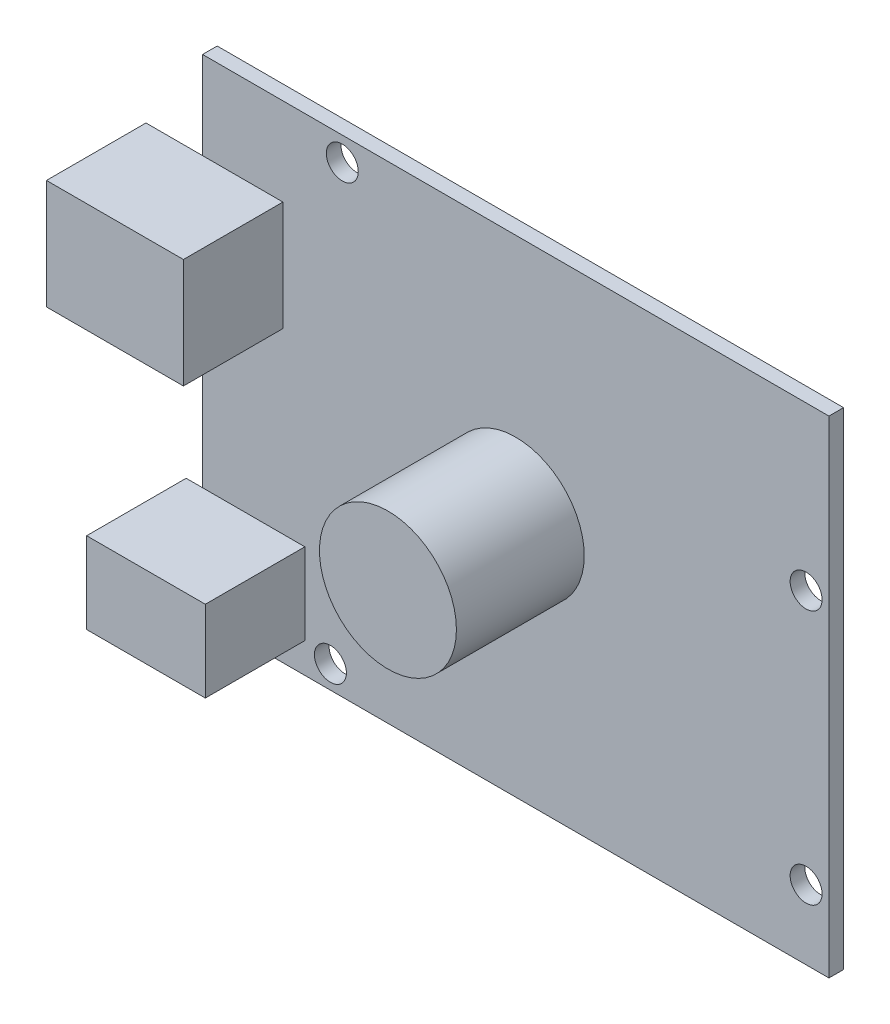
ISO-10303-21;
HEADER;
FILE_DESCRIPTION(('STEP AP214'),'2;1');
FILE_NAME('part.step','',(''),(''),'','','');
FILE_SCHEMA(('AUTOMOTIVE_DESIGN { 1 0 10303 214 1 1 1 1 }'));
ENDSEC;
DATA;
#1=APPLICATION_CONTEXT('core data for automotive mechanical design processes');
#2=APPLICATION_PROTOCOL_DEFINITION('international standard','automotive_design',2000,#1);
#3=PRODUCT_CONTEXT('',#1,'mechanical');
#4=PRODUCT('Part','Part','',(#3));
#5=PRODUCT_RELATED_PRODUCT_CATEGORY('part','',(#4));
#6=PRODUCT_DEFINITION_FORMATION('','',#4);
#7=PRODUCT_DEFINITION_CONTEXT('part definition',#1,'design');
#8=PRODUCT_DEFINITION('design','',#6,#7);
#9=PRODUCT_DEFINITION_SHAPE('','',#8);
#10=(LENGTH_UNIT() NAMED_UNIT(*) SI_UNIT(.MILLI.,.METRE.));
#11=(NAMED_UNIT(*) PLANE_ANGLE_UNIT() SI_UNIT($,.RADIAN.));
#12=(NAMED_UNIT(*) SI_UNIT($,.STERADIAN.) SOLID_ANGLE_UNIT());
#13=UNCERTAINTY_MEASURE_WITH_UNIT(LENGTH_MEASURE(1.E-05),#10,'distance_accuracy_value','');
#14=(GEOMETRIC_REPRESENTATION_CONTEXT(3) GLOBAL_UNCERTAINTY_ASSIGNED_CONTEXT((#13)) GLOBAL_UNIT_ASSIGNED_CONTEXT((#10,
#11,#12)) REPRESENTATION_CONTEXT('',''));
#15=CARTESIAN_POINT('',(0.,0.,0.));
#16=DIRECTION('',(0.,0.,1.));
#17=DIRECTION('',(1.,0.,0.));
#18=AXIS2_PLACEMENT_3D('',#15,#16,#17);
#19=CARTESIAN_POINT('',(0.,0.,1.6));
#20=DIRECTION('',(0.,0.,1.));
#21=DIRECTION('',(1.,0.,0.));
#22=AXIS2_PLACEMENT_3D('',#19,#20,#21);
#23=PLANE('',#22);
#24=DIRECTION('',(0.,1.,0.));
#25=VECTOR('',#24,1.);
#26=CARTESIAN_POINT('',(-23.1,-14.45,1.6));
#27=LINE('',#26,#25);
#28=CARTESIAN_POINT('',(-23.1,-23.35,1.6));
#29=VERTEX_POINT('',#28);
#30=CARTESIAN_POINT('',(-23.1,-14.45,1.6));
#31=VERTEX_POINT('',#30);
#32=EDGE_CURVE('E384',#29,#31,#27,.T.);
#33=ORIENTED_EDGE('',*,*,#32,.F.);
#34=DIRECTION('',(-1.,0.,0.));
#35=VECTOR('',#34,1.);
#36=CARTESIAN_POINT('',(0.,-23.35,1.6));
#37=LINE('',#36,#35);
#38=CARTESIAN_POINT('',(-34.3,-23.35,1.6));
#39=VERTEX_POINT('',#38);
#40=EDGE_CURVE('E11',#29,#39,#37,.T.);
#41=ORIENTED_EDGE('',*,*,#40,.T.);
#42=DIRECTION('',(0.,-1.,0.));
#43=VECTOR('',#42,1.);
#44=CARTESIAN_POINT('',(-34.3,26.65,1.6));
#45=LINE('',#44,#43);
#46=CARTESIAN_POINT('',(-34.3,-26.65,1.6));
#47=VERTEX_POINT('',#46);
#48=EDGE_CURVE('E201',#39,#47,#45,.T.);
#49=ORIENTED_EDGE('',*,*,#48,.T.);
#50=DIRECTION('',(1.,0.,0.));
#51=VECTOR('',#50,1.);
#52=CARTESIAN_POINT('',(-34.3,-26.65,1.6));
#53=LINE('',#52,#51);
#54=CARTESIAN_POINT('',(34.3,-26.65,1.6));
#55=VERTEX_POINT('',#54);
#56=EDGE_CURVE('E199',#47,#55,#53,.T.);
#57=ORIENTED_EDGE('',*,*,#56,.T.);
#58=DIRECTION('',(0.,1.,0.));
#59=VECTOR('',#58,1.);
#60=CARTESIAN_POINT('',(34.3,26.65,1.6));
#61=LINE('',#60,#59);
#62=CARTESIAN_POINT('',(34.3,26.65,1.6));
#63=VERTEX_POINT('',#62);
#64=EDGE_CURVE('E203',#55,#63,#61,.T.);
#65=ORIENTED_EDGE('',*,*,#64,.T.);
#66=DIRECTION('',(-1.,0.,0.));
#67=VECTOR('',#66,1.);
#68=CARTESIAN_POINT('',(-34.3,26.65,1.6));
#69=LINE('',#68,#67);
#70=CARTESIAN_POINT('',(-34.3,26.65,1.6));
#71=VERTEX_POINT('',#70);
#72=EDGE_CURVE('E205',#63,#71,#69,.T.);
#73=ORIENTED_EDGE('',*,*,#72,.T.);
#74=CARTESIAN_POINT('',(-34.3,17.05,1.6));
#75=VERTEX_POINT('',#74);
#76=EDGE_CURVE('E197',#71,#75,#45,.T.);
#77=ORIENTED_EDGE('',*,*,#76,.T.);
#78=DIRECTION('',(-1.,0.,0.));
#79=VECTOR('',#78,1.);
#80=CARTESIAN_POINT('',(-40.5,17.05,1.6));
#81=LINE('',#80,#79);
#82=CARTESIAN_POINT('',(-25.5,17.05,1.6));
#83=VERTEX_POINT('',#82);
#84=EDGE_CURVE('E55',#83,#75,#81,.T.);
#85=ORIENTED_EDGE('',*,*,#84,.F.);
#86=DIRECTION('',(0.,1.,0.));
#87=VECTOR('',#86,1.);
#88=CARTESIAN_POINT('',(-25.5,17.05,1.6));
#89=LINE('',#88,#87);
#90=CARTESIAN_POINT('',(-25.5,5.05,1.6));
#91=VERTEX_POINT('',#90);
#92=EDGE_CURVE('E181',#91,#83,#89,.T.);
#93=ORIENTED_EDGE('',*,*,#92,.F.);
#94=DIRECTION('',(1.,0.,0.));
#95=VECTOR('',#94,1.);
#96=CARTESIAN_POINT('',(-40.5,5.05,1.6));
#97=LINE('',#96,#95);
#98=CARTESIAN_POINT('',(-34.3,5.05000000000001,1.6));
#99=VERTEX_POINT('',#98);
#100=EDGE_CURVE('E40',#99,#91,#97,.T.);
#101=ORIENTED_EDGE('',*,*,#100,.F.);
#102=CARTESIAN_POINT('',(-34.3,-14.45,1.6));
#103=VERTEX_POINT('',#102);
#104=EDGE_CURVE('E253',#99,#103,#45,.T.);
#105=ORIENTED_EDGE('',*,*,#104,.T.);
#106=DIRECTION('',(-1.,0.,0.));
#107=VECTOR('',#106,1.);
#108=CARTESIAN_POINT('',(-36.1,-14.45,1.6));
#109=LINE('',#108,#107);
#110=EDGE_CURVE('E156',#31,#103,#109,.T.);
#111=ORIENTED_EDGE('',*,*,#110,.F.);
#112=EDGE_LOOP('',(#33,#41,#49,#57,#65,#73,#77,#85,#93,#101,#105,#111));
#113=FACE_BOUND('',#112,.T.);
#114=CARTESIAN_POINT('',(-19.,24.05,1.6));
#115=DIRECTION('',(0.,0.,1.));
#116=DIRECTION('',(1.,0.,0.));
#117=AXIS2_PLACEMENT_3D('',#114,#115,#116);
#118=CIRCLE('',#117,1.75);
#119=CARTESIAN_POINT('',(-17.25,24.05,1.6));
#120=VERTEX_POINT('',#119);
#121=EDGE_CURVE('E370',#120,#120,#118,.T.);
#122=ORIENTED_EDGE('',*,*,#121,.F.);
#123=EDGE_LOOP('',(#122));
#124=FACE_BOUND('',#123,.T.);
#125=CARTESIAN_POINT('',(-20.3,-24.15,1.6));
#126=DIRECTION('',(0.,0.,1.));
#127=DIRECTION('',(1.,0.,0.));
#128=AXIS2_PLACEMENT_3D('',#125,#126,#127);
#129=CIRCLE('',#128,1.75);
#130=CARTESIAN_POINT('',(-18.55,-24.15,1.6));
#131=VERTEX_POINT('',#130);
#132=EDGE_CURVE('E364',#131,#131,#129,.T.);
#133=ORIENTED_EDGE('',*,*,#132,.F.);
#134=EDGE_LOOP('',(#133));
#135=FACE_BOUND('',#134,.T.);
#136=CARTESIAN_POINT('',(31.8,-19.05,1.6));
#137=DIRECTION('',(0.,0.,1.));
#138=DIRECTION('',(1.,0.,0.));
#139=AXIS2_PLACEMENT_3D('',#136,#137,#138);
#140=CIRCLE('',#139,1.75);
#141=CARTESIAN_POINT('',(33.55,-19.05,1.6));
#142=VERTEX_POINT('',#141);
#143=EDGE_CURVE('E359',#142,#142,#140,.T.);
#144=ORIENTED_EDGE('',*,*,#143,.F.);
#145=EDGE_LOOP('',(#144));
#146=FACE_BOUND('',#145,.T.);
#147=CARTESIAN_POINT('',(31.8,8.84999999999999,1.6));
#148=DIRECTION('',(0.,0.,1.));
#149=DIRECTION('',(1.,0.,0.));
#150=AXIS2_PLACEMENT_3D('',#147,#148,#149);
#151=CIRCLE('',#150,1.75);
#152=CARTESIAN_POINT('',(33.55,8.84999999999999,1.6));
#153=VERTEX_POINT('',#152);
#154=EDGE_CURVE('E349',#153,#153,#151,.T.);
#155=ORIENTED_EDGE('',*,*,#154,.F.);
#156=EDGE_LOOP('',(#155));
#157=FACE_BOUND('',#156,.T.);
#158=CARTESIAN_POINT('',(0.,0.,1.6));
#159=DIRECTION('',(0.,0.,1.));
#160=DIRECTION('',(1.,0.,0.));
#161=AXIS2_PLACEMENT_3D('',#158,#159,#160);
#162=CIRCLE('',#161,7.5);
#163=CARTESIAN_POINT('',(7.5,0.,1.6));
#164=VERTEX_POINT('',#163);
#165=EDGE_CURVE('E350',#164,#164,#162,.T.);
#166=ORIENTED_EDGE('',*,*,#165,.F.);
#167=EDGE_LOOP('',(#166));
#168=FACE_BOUND('',#167,.T.);
#169=ADVANCED_FACE('F32',(#113,#124,#135,#146,#157,#168),#23,.T.);
#170=CARTESIAN_POINT('',(-34.3,26.65,1.6));
#171=DIRECTION('',(1.,0.,0.));
#172=DIRECTION('',(0.,0.,-1.));
#173=AXIS2_PLACEMENT_3D('',#170,#171,#172);
#174=PLANE('',#173);
#175=DIRECTION('',(0.,-1.,0.));
#176=VECTOR('',#175,1.);
#177=CARTESIAN_POINT('',(-34.3,26.65,0.));
#178=LINE('',#177,#176);
#179=CARTESIAN_POINT('',(-34.3,26.65,0.));
#180=VERTEX_POINT('',#179);
#181=CARTESIAN_POINT('',(-34.3,-26.65,0.));
#182=VERTEX_POINT('',#181);
#183=EDGE_CURVE('E196',#180,#182,#178,.T.);
#184=ORIENTED_EDGE('',*,*,#183,.T.);
#185=DIRECTION('',(0.,0.,-1.));
#186=VECTOR('',#185,1.);
#187=CARTESIAN_POINT('',(-34.3,-26.65,1.6));
#188=LINE('',#187,#186);
#189=EDGE_CURVE('E223',#47,#182,#188,.T.);
#190=ORIENTED_EDGE('',*,*,#189,.F.);
#191=ORIENTED_EDGE('',*,*,#48,.F.);
#192=EDGE_CURVE('E254',#103,#39,#45,.T.);
#193=ORIENTED_EDGE('',*,*,#192,.F.);
#194=ORIENTED_EDGE('',*,*,#104,.F.);
#195=EDGE_CURVE('E200',#75,#99,#45,.T.);
#196=ORIENTED_EDGE('',*,*,#195,.F.);
#197=ORIENTED_EDGE('',*,*,#76,.F.);
#198=DIRECTION('',(0.,0.,-1.));
#199=VECTOR('',#198,1.);
#200=CARTESIAN_POINT('',(-34.3,26.65,1.6));
#201=LINE('',#200,#199);
#202=EDGE_CURVE('E207',#71,#180,#201,.T.);
#203=ORIENTED_EDGE('',*,*,#202,.T.);
#204=EDGE_LOOP('',(#184,#190,#191,#193,#194,#196,#197,#203));
#205=FACE_BOUND('',#204,.T.);
#206=ADVANCED_FACE('F34',(#205),#174,.F.);
#207=CARTESIAN_POINT('',(-34.3,-26.65,1.6));
#208=DIRECTION('',(0.,1.,0.));
#209=DIRECTION('',(-1.,0.,0.));
#210=AXIS2_PLACEMENT_3D('',#207,#208,#209);
#211=PLANE('',#210);
#212=DIRECTION('',(1.,0.,0.));
#213=VECTOR('',#212,1.);
#214=CARTESIAN_POINT('',(-34.3,-26.65,0.));
#215=LINE('',#214,#213);
#216=CARTESIAN_POINT('',(34.3,-26.65,0.));
#217=VERTEX_POINT('',#216);
#218=EDGE_CURVE('E210',#182,#217,#215,.T.);
#219=ORIENTED_EDGE('',*,*,#218,.T.);
#220=DIRECTION('',(0.,0.,-1.));
#221=VECTOR('',#220,1.);
#222=CARTESIAN_POINT('',(34.3,-26.65,1.6));
#223=LINE('',#222,#221);
#224=EDGE_CURVE('E221',#55,#217,#223,.T.);
#225=ORIENTED_EDGE('',*,*,#224,.F.);
#226=ORIENTED_EDGE('',*,*,#56,.F.);
#227=ORIENTED_EDGE('',*,*,#189,.T.);
#228=EDGE_LOOP('',(#219,#225,#226,#227));
#229=FACE_BOUND('',#228,.T.);
#230=ADVANCED_FACE('F262',(#229),#211,.F.);
#231=CARTESIAN_POINT('',(34.3,26.65,1.6));
#232=DIRECTION('',(-1.,0.,0.));
#233=DIRECTION('',(0.,0.,1.));
#234=AXIS2_PLACEMENT_3D('',#231,#232,#233);
#235=PLANE('',#234);
#236=DIRECTION('',(0.,1.,0.));
#237=VECTOR('',#236,1.);
#238=CARTESIAN_POINT('',(34.3,26.65,0.));
#239=LINE('',#238,#237);
#240=CARTESIAN_POINT('',(34.3,26.65,0.));
#241=VERTEX_POINT('',#240);
#242=EDGE_CURVE('E212',#217,#241,#239,.T.);
#243=ORIENTED_EDGE('',*,*,#242,.T.);
#244=DIRECTION('',(0.,0.,-1.));
#245=VECTOR('',#244,1.);
#246=CARTESIAN_POINT('',(34.3,26.65,1.6));
#247=LINE('',#246,#245);
#248=EDGE_CURVE('E218',#63,#241,#247,.T.);
#249=ORIENTED_EDGE('',*,*,#248,.F.);
#250=ORIENTED_EDGE('',*,*,#64,.F.);
#251=ORIENTED_EDGE('',*,*,#224,.T.);
#252=EDGE_LOOP('',(#243,#249,#250,#251));
#253=FACE_BOUND('',#252,.T.);
#254=ADVANCED_FACE('F271',(#253),#235,.F.);
#255=CARTESIAN_POINT('',(-34.3,26.65,1.6));
#256=DIRECTION('',(0.,-1.,0.));
#257=DIRECTION('',(0.,0.,-1.));
#258=AXIS2_PLACEMENT_3D('',#255,#256,#257);
#259=PLANE('',#258);
#260=DIRECTION('',(-1.,0.,0.));
#261=VECTOR('',#260,1.);
#262=CARTESIAN_POINT('',(-34.3,26.65,0.));
#263=LINE('',#262,#261);
#264=EDGE_CURVE('E214',#241,#180,#263,.T.);
#265=ORIENTED_EDGE('',*,*,#264,.T.);
#266=ORIENTED_EDGE('',*,*,#202,.F.);
#267=ORIENTED_EDGE('',*,*,#72,.F.);
#268=ORIENTED_EDGE('',*,*,#248,.T.);
#269=EDGE_LOOP('',(#265,#266,#267,#268));
#270=FACE_BOUND('',#269,.T.);
#271=ADVANCED_FACE('F275',(#270),#259,.F.);
#272=CARTESIAN_POINT('',(0.,0.,0.));
#273=DIRECTION('',(0.,0.,1.));
#274=DIRECTION('',(1.,0.,0.));
#275=AXIS2_PLACEMENT_3D('',#272,#273,#274);
#276=PLANE('',#275);
#277=CARTESIAN_POINT('',(31.8,8.84999999999999,0.));
#278=DIRECTION('',(0.,0.,1.));
#279=DIRECTION('',(1.,0.,0.));
#280=AXIS2_PLACEMENT_3D('',#277,#278,#279);
#281=CIRCLE('',#280,1.75);
#282=CARTESIAN_POINT('',(33.55,8.84999999999999,0.));
#283=VERTEX_POINT('',#282);
#284=EDGE_CURVE('E353',#283,#283,#281,.T.);
#285=ORIENTED_EDGE('',*,*,#284,.T.);
#286=EDGE_LOOP('',(#285));
#287=FACE_BOUND('',#286,.T.);
#288=CARTESIAN_POINT('',(31.8,-19.05,0.));
#289=DIRECTION('',(0.,0.,1.));
#290=DIRECTION('',(1.,0.,0.));
#291=AXIS2_PLACEMENT_3D('',#288,#289,#290);
#292=CIRCLE('',#291,1.75);
#293=CARTESIAN_POINT('',(33.55,-19.05,0.));
#294=VERTEX_POINT('',#293);
#295=EDGE_CURVE('E361',#294,#294,#292,.T.);
#296=ORIENTED_EDGE('',*,*,#295,.T.);
#297=EDGE_LOOP('',(#296));
#298=FACE_BOUND('',#297,.T.);
#299=CARTESIAN_POINT('',(-20.3,-24.15,0.));
#300=DIRECTION('',(0.,0.,1.));
#301=DIRECTION('',(1.,0.,0.));
#302=AXIS2_PLACEMENT_3D('',#299,#300,#301);
#303=CIRCLE('',#302,1.75);
#304=CARTESIAN_POINT('',(-18.55,-24.15,0.));
#305=VERTEX_POINT('',#304);
#306=EDGE_CURVE('E367',#305,#305,#303,.T.);
#307=ORIENTED_EDGE('',*,*,#306,.T.);
#308=EDGE_LOOP('',(#307));
#309=FACE_BOUND('',#308,.T.);
#310=CARTESIAN_POINT('',(-19.,24.05,0.));
#311=DIRECTION('',(0.,0.,1.));
#312=DIRECTION('',(1.,0.,0.));
#313=AXIS2_PLACEMENT_3D('',#310,#311,#312);
#314=CIRCLE('',#313,1.75);
#315=CARTESIAN_POINT('',(-17.25,24.05,0.));
#316=VERTEX_POINT('',#315);
#317=EDGE_CURVE('E373',#316,#316,#314,.T.);
#318=ORIENTED_EDGE('',*,*,#317,.T.);
#319=EDGE_LOOP('',(#318));
#320=FACE_BOUND('',#319,.T.);
#321=ORIENTED_EDGE('',*,*,#183,.F.);
#322=ORIENTED_EDGE('',*,*,#264,.F.);
#323=ORIENTED_EDGE('',*,*,#242,.F.);
#324=ORIENTED_EDGE('',*,*,#218,.F.);
#325=EDGE_LOOP('',(#321,#322,#323,#324));
#326=FACE_BOUND('',#325,.T.);
#327=ADVANCED_FACE('F268',(#287,#298,#309,#320,#326),#276,.F.);
#328=CARTESIAN_POINT('',(0.,0.,1.6));
#329=DIRECTION('',(0.,0.,1.));
#330=DIRECTION('',(1.,0.,0.));
#331=AXIS2_PLACEMENT_3D('',#328,#329,#330);
#332=PLANE('',#331);
#333=CARTESIAN_POINT('',(-40.5,17.05,1.6));
#334=VERTEX_POINT('',#333);
#335=EDGE_CURVE('E183',#75,#334,#81,.T.);
#336=ORIENTED_EDGE('',*,*,#335,.F.);
#337=ORIENTED_EDGE('',*,*,#195,.T.);
#338=CARTESIAN_POINT('',(-40.5,5.05,1.6));
#339=VERTEX_POINT('',#338);
#340=EDGE_CURVE('E164',#339,#99,#97,.T.);
#341=ORIENTED_EDGE('',*,*,#340,.F.);
#342=DIRECTION('',(0.,-1.,0.));
#343=VECTOR('',#342,1.);
#344=CARTESIAN_POINT('',(-40.5,17.05,1.6));
#345=LINE('',#344,#343);
#346=EDGE_CURVE('E161',#334,#339,#345,.T.);
#347=ORIENTED_EDGE('',*,*,#346,.F.);
#348=EDGE_LOOP('',(#336,#337,#341,#347));
#349=FACE_BOUND('',#348,.T.);
#350=ADVANCED_FACE('F249',(#349),#332,.F.);
#351=CARTESIAN_POINT('',(-40.5,17.05,12.5));
#352=DIRECTION('',(1.,0.,0.));
#353=DIRECTION('',(0.,1.,0.));
#354=AXIS2_PLACEMENT_3D('',#351,#352,#353);
#355=PLANE('',#354);
#356=ORIENTED_EDGE('',*,*,#346,.T.);
#357=DIRECTION('',(0.,0.,-1.));
#358=VECTOR('',#357,1.);
#359=CARTESIAN_POINT('',(-40.5,5.05,12.5));
#360=LINE('',#359,#358);
#361=CARTESIAN_POINT('',(-40.5,5.05,12.5));
#362=VERTEX_POINT('',#361);
#363=EDGE_CURVE('E193',#362,#339,#360,.T.);
#364=ORIENTED_EDGE('',*,*,#363,.F.);
#365=DIRECTION('',(0.,-1.,0.));
#366=VECTOR('',#365,1.);
#367=CARTESIAN_POINT('',(-40.5,17.05,12.5));
#368=LINE('',#367,#366);
#369=CARTESIAN_POINT('',(-40.5,17.05,12.5));
#370=VERTEX_POINT('',#369);
#371=EDGE_CURVE('E169',#370,#362,#368,.T.);
#372=ORIENTED_EDGE('',*,*,#371,.F.);
#373=DIRECTION('',(0.,0.,-1.));
#374=VECTOR('',#373,1.);
#375=CARTESIAN_POINT('',(-40.5,17.05,12.5));
#376=LINE('',#375,#374);
#377=EDGE_CURVE('E177',#370,#334,#376,.T.);
#378=ORIENTED_EDGE('',*,*,#377,.T.);
#379=EDGE_LOOP('',(#356,#364,#372,#378));
#380=FACE_BOUND('',#379,.T.);
#381=ADVANCED_FACE('F246',(#380),#355,.F.);
#382=CARTESIAN_POINT('',(-40.5,5.05,12.5));
#383=DIRECTION('',(0.,1.,0.));
#384=DIRECTION('',(0.,0.,1.));
#385=AXIS2_PLACEMENT_3D('',#382,#383,#384);
#386=PLANE('',#385);
#387=ORIENTED_EDGE('',*,*,#340,.T.);
#388=ORIENTED_EDGE('',*,*,#100,.T.);
#389=DIRECTION('',(0.,0.,-1.));
#390=VECTOR('',#389,1.);
#391=CARTESIAN_POINT('',(-25.5,5.05,12.5));
#392=LINE('',#391,#390);
#393=CARTESIAN_POINT('',(-25.5,5.05,12.5));
#394=VERTEX_POINT('',#393);
#395=EDGE_CURVE('E190',#394,#91,#392,.T.);
#396=ORIENTED_EDGE('',*,*,#395,.F.);
#397=DIRECTION('',(1.,0.,0.));
#398=VECTOR('',#397,1.);
#399=CARTESIAN_POINT('',(-40.5,5.05,12.5));
#400=LINE('',#399,#398);
#401=EDGE_CURVE('E172',#362,#394,#400,.T.);
#402=ORIENTED_EDGE('',*,*,#401,.F.);
#403=ORIENTED_EDGE('',*,*,#363,.T.);
#404=EDGE_LOOP('',(#387,#388,#396,#402,#403));
#405=FACE_BOUND('',#404,.T.);
#406=ADVANCED_FACE('F231',(#405),#386,.F.);
#407=CARTESIAN_POINT('',(-25.5,17.05,12.5));
#408=DIRECTION('',(-1.,0.,0.));
#409=DIRECTION('',(0.,0.,1.));
#410=AXIS2_PLACEMENT_3D('',#407,#408,#409);
#411=PLANE('',#410);
#412=ORIENTED_EDGE('',*,*,#92,.T.);
#413=DIRECTION('',(0.,0.,-1.));
#414=VECTOR('',#413,1.);
#415=CARTESIAN_POINT('',(-25.5,17.05,12.5));
#416=LINE('',#415,#414);
#417=CARTESIAN_POINT('',(-25.5,17.05,12.5));
#418=VERTEX_POINT('',#417);
#419=EDGE_CURVE('E187',#418,#83,#416,.T.);
#420=ORIENTED_EDGE('',*,*,#419,.F.);
#421=DIRECTION('',(0.,1.,0.));
#422=VECTOR('',#421,1.);
#423=CARTESIAN_POINT('',(-25.5,17.05,12.5));
#424=LINE('',#423,#422);
#425=EDGE_CURVE('E174',#394,#418,#424,.T.);
#426=ORIENTED_EDGE('',*,*,#425,.F.);
#427=ORIENTED_EDGE('',*,*,#395,.T.);
#428=EDGE_LOOP('',(#412,#420,#426,#427));
#429=FACE_BOUND('',#428,.T.);
#430=ADVANCED_FACE('F236',(#429),#411,.F.);
#431=CARTESIAN_POINT('',(-40.5,17.05,12.5));
#432=DIRECTION('',(0.,-1.,0.));
#433=DIRECTION('',(0.,0.,-1.));
#434=AXIS2_PLACEMENT_3D('',#431,#432,#433);
#435=PLANE('',#434);
#436=ORIENTED_EDGE('',*,*,#84,.T.);
#437=ORIENTED_EDGE('',*,*,#335,.T.);
#438=ORIENTED_EDGE('',*,*,#377,.F.);
#439=DIRECTION('',(-1.,0.,0.));
#440=VECTOR('',#439,1.);
#441=CARTESIAN_POINT('',(-40.5,17.05,12.5));
#442=LINE('',#441,#440);
#443=EDGE_CURVE('E176',#418,#370,#442,.T.);
#444=ORIENTED_EDGE('',*,*,#443,.F.);
#445=ORIENTED_EDGE('',*,*,#419,.T.);
#446=EDGE_LOOP('',(#436,#437,#438,#444,#445));
#447=FACE_BOUND('',#446,.T.);
#448=ADVANCED_FACE('F297',(#447),#435,.F.);
#449=CARTESIAN_POINT('',(0.,0.,12.5));
#450=DIRECTION('',(0.,0.,1.));
#451=DIRECTION('',(1.,0.,0.));
#452=AXIS2_PLACEMENT_3D('',#449,#450,#451);
#453=PLANE('',#452);
#454=ORIENTED_EDGE('',*,*,#371,.T.);
#455=ORIENTED_EDGE('',*,*,#401,.T.);
#456=ORIENTED_EDGE('',*,*,#425,.T.);
#457=ORIENTED_EDGE('',*,*,#443,.T.);
#458=EDGE_LOOP('',(#454,#455,#456,#457));
#459=FACE_BOUND('',#458,.T.);
#460=ADVANCED_FACE('F240',(#459),#453,.T.);
#461=CARTESIAN_POINT('',(0.,0.,1.6));
#462=DIRECTION('',(0.,0.,1.));
#463=DIRECTION('',(1.,0.,0.));
#464=AXIS2_PLACEMENT_3D('',#461,#462,#463);
#465=PLANE('',#464);
#466=CARTESIAN_POINT('',(-36.1,-14.45,1.6));
#467=VERTEX_POINT('',#466);
#468=EDGE_CURVE('E386',#103,#467,#109,.T.);
#469=ORIENTED_EDGE('',*,*,#468,.F.);
#470=ORIENTED_EDGE('',*,*,#192,.T.);
#471=DIRECTION('',(1.,0.,0.));
#472=VECTOR('',#471,1.);
#473=CARTESIAN_POINT('',(-36.1,-23.35,1.6));
#474=LINE('',#473,#472);
#475=CARTESIAN_POINT('',(-36.1,-23.35,1.6));
#476=VERTEX_POINT('',#475);
#477=EDGE_CURVE('E382',#476,#39,#474,.T.);
#478=ORIENTED_EDGE('',*,*,#477,.F.);
#479=DIRECTION('',(0.,-1.,0.));
#480=VECTOR('',#479,1.);
#481=CARTESIAN_POINT('',(-36.1,-14.45,1.6));
#482=LINE('',#481,#480);
#483=EDGE_CURVE('E160',#467,#476,#482,.T.);
#484=ORIENTED_EDGE('',*,*,#483,.F.);
#485=EDGE_LOOP('',(#469,#470,#478,#484));
#486=FACE_BOUND('',#485,.T.);
#487=ADVANCED_FACE('F305',(#486),#465,.F.);
#488=CARTESIAN_POINT('',(-36.1,-14.45,12.5));
#489=DIRECTION('',(1.,0.,0.));
#490=DIRECTION('',(0.,0.,-1.));
#491=AXIS2_PLACEMENT_3D('',#488,#489,#490);
#492=PLANE('',#491);
#493=ORIENTED_EDGE('',*,*,#483,.T.);
#494=DIRECTION('',(0.,0.,-1.));
#495=VECTOR('',#494,1.);
#496=CARTESIAN_POINT('',(-36.1,-23.35,12.5));
#497=LINE('',#496,#495);
#498=CARTESIAN_POINT('',(-36.1,-23.35,12.5));
#499=VERTEX_POINT('',#498);
#500=EDGE_CURVE('E141',#499,#476,#497,.T.);
#501=ORIENTED_EDGE('',*,*,#500,.F.);
#502=DIRECTION('',(0.,-1.,0.));
#503=VECTOR('',#502,1.);
#504=CARTESIAN_POINT('',(-36.1,-14.45,12.5));
#505=LINE('',#504,#503);
#506=CARTESIAN_POINT('',(-36.1,-14.45,12.5));
#507=VERTEX_POINT('',#506);
#508=EDGE_CURVE('E148',#507,#499,#505,.T.);
#509=ORIENTED_EDGE('',*,*,#508,.F.);
#510=DIRECTION('',(0.,0.,-1.));
#511=VECTOR('',#510,1.);
#512=CARTESIAN_POINT('',(-36.1,-14.45,12.5));
#513=LINE('',#512,#511);
#514=EDGE_CURVE('E380',#507,#467,#513,.T.);
#515=ORIENTED_EDGE('',*,*,#514,.T.);
#516=EDGE_LOOP('',(#493,#501,#509,#515));
#517=FACE_BOUND('',#516,.T.);
#518=ADVANCED_FACE('F158',(#517),#492,.F.);
#519=CARTESIAN_POINT('',(-36.1,-23.35,12.5));
#520=DIRECTION('',(0.,1.,0.));
#521=DIRECTION('',(0.,0.,1.));
#522=AXIS2_PLACEMENT_3D('',#519,#520,#521);
#523=PLANE('',#522);
#524=ORIENTED_EDGE('',*,*,#477,.T.);
#525=ORIENTED_EDGE('',*,*,#40,.F.);
#526=DIRECTION('',(0.,0.,-1.));
#527=VECTOR('',#526,1.);
#528=CARTESIAN_POINT('',(-23.1,-23.35,12.5));
#529=LINE('',#528,#527);
#530=CARTESIAN_POINT('',(-23.1,-23.35,12.5));
#531=VERTEX_POINT('',#530);
#532=EDGE_CURVE('E144',#531,#29,#529,.T.);
#533=ORIENTED_EDGE('',*,*,#532,.F.);
#534=DIRECTION('',(1.,0.,0.));
#535=VECTOR('',#534,1.);
#536=CARTESIAN_POINT('',(-36.1,-23.35,12.5));
#537=LINE('',#536,#535);
#538=EDGE_CURVE('E136',#499,#531,#537,.T.);
#539=ORIENTED_EDGE('',*,*,#538,.F.);
#540=ORIENTED_EDGE('',*,*,#500,.T.);
#541=EDGE_LOOP('',(#524,#525,#533,#539,#540));
#542=FACE_BOUND('',#541,.T.);
#543=ADVANCED_FACE('F139',(#542),#523,.F.);
#544=CARTESIAN_POINT('',(-23.1,-14.45,12.5));
#545=DIRECTION('',(-1.,0.,0.));
#546=DIRECTION('',(0.,0.,1.));
#547=AXIS2_PLACEMENT_3D('',#544,#545,#546);
#548=PLANE('',#547);
#549=ORIENTED_EDGE('',*,*,#32,.T.);
#550=DIRECTION('',(0.,0.,-1.));
#551=VECTOR('',#550,1.);
#552=CARTESIAN_POINT('',(-23.1,-14.45,12.5));
#553=LINE('',#552,#551);
#554=CARTESIAN_POINT('',(-23.1,-14.45,12.5));
#555=VERTEX_POINT('',#554);
#556=EDGE_CURVE('E47',#555,#31,#553,.T.);
#557=ORIENTED_EDGE('',*,*,#556,.F.);
#558=DIRECTION('',(0.,1.,0.));
#559=VECTOR('',#558,1.);
#560=CARTESIAN_POINT('',(-23.1,-14.45,12.5));
#561=LINE('',#560,#559);
#562=EDGE_CURVE('E147',#531,#555,#561,.T.);
#563=ORIENTED_EDGE('',*,*,#562,.F.);
#564=ORIENTED_EDGE('',*,*,#532,.T.);
#565=EDGE_LOOP('',(#549,#557,#563,#564));
#566=FACE_BOUND('',#565,.T.);
#567=ADVANCED_FACE('F310',(#566),#548,.F.);
#568=CARTESIAN_POINT('',(-36.1,-14.45,12.5));
#569=DIRECTION('',(0.,-1.,0.));
#570=DIRECTION('',(0.,0.,-1.));
#571=AXIS2_PLACEMENT_3D('',#568,#569,#570);
#572=PLANE('',#571);
#573=ORIENTED_EDGE('',*,*,#110,.T.);
#574=ORIENTED_EDGE('',*,*,#468,.T.);
#575=ORIENTED_EDGE('',*,*,#514,.F.);
#576=DIRECTION('',(-1.,0.,0.));
#577=VECTOR('',#576,1.);
#578=CARTESIAN_POINT('',(-36.1,-14.45,12.5));
#579=LINE('',#578,#577);
#580=EDGE_CURVE('E152',#555,#507,#579,.T.);
#581=ORIENTED_EDGE('',*,*,#580,.F.);
#582=ORIENTED_EDGE('',*,*,#556,.T.);
#583=EDGE_LOOP('',(#573,#574,#575,#581,#582));
#584=FACE_BOUND('',#583,.T.);
#585=ADVANCED_FACE('F313',(#584),#572,.F.);
#586=CARTESIAN_POINT('',(0.,0.,12.5));
#587=DIRECTION('',(0.,0.,1.));
#588=DIRECTION('',(1.,0.,0.));
#589=AXIS2_PLACEMENT_3D('',#586,#587,#588);
#590=PLANE('',#589);
#591=ORIENTED_EDGE('',*,*,#508,.T.);
#592=ORIENTED_EDGE('',*,*,#538,.T.);
#593=ORIENTED_EDGE('',*,*,#562,.T.);
#594=ORIENTED_EDGE('',*,*,#580,.T.);
#595=EDGE_LOOP('',(#591,#592,#593,#594));
#596=FACE_BOUND('',#595,.T.);
#597=ADVANCED_FACE('F151',(#596),#590,.T.);
#598=CARTESIAN_POINT('',(-19.,24.05,0.));
#599=DIRECTION('',(0.,0.,1.));
#600=DIRECTION('',(1.,0.,0.));
#601=AXIS2_PLACEMENT_3D('',#598,#599,#600);
#602=CYLINDRICAL_SURFACE('',#601,1.75);
#603=ORIENTED_EDGE('',*,*,#317,.F.);
#604=EDGE_LOOP('',(#603));
#605=FACE_BOUND('',#604,.T.);
#606=ORIENTED_EDGE('',*,*,#121,.T.);
#607=EDGE_LOOP('',(#606));
#608=FACE_BOUND('',#607,.T.);
#609=ADVANCED_FACE('F321',(#605,#608),#602,.F.);
#610=CARTESIAN_POINT('',(-20.3,-24.15,0.));
#611=DIRECTION('',(0.,0.,1.));
#612=DIRECTION('',(1.,0.,0.));
#613=AXIS2_PLACEMENT_3D('',#610,#611,#612);
#614=CYLINDRICAL_SURFACE('',#613,1.75);
#615=ORIENTED_EDGE('',*,*,#306,.F.);
#616=EDGE_LOOP('',(#615));
#617=FACE_BOUND('',#616,.T.);
#618=ORIENTED_EDGE('',*,*,#132,.T.);
#619=EDGE_LOOP('',(#618));
#620=FACE_BOUND('',#619,.T.);
#621=ADVANCED_FACE('F324',(#617,#620),#614,.F.);
#622=CARTESIAN_POINT('',(31.8,-19.05,0.));
#623=DIRECTION('',(0.,0.,1.));
#624=DIRECTION('',(1.,0.,0.));
#625=AXIS2_PLACEMENT_3D('',#622,#623,#624);
#626=CYLINDRICAL_SURFACE('',#625,1.75);
#627=ORIENTED_EDGE('',*,*,#295,.F.);
#628=EDGE_LOOP('',(#627));
#629=FACE_BOUND('',#628,.T.);
#630=ORIENTED_EDGE('',*,*,#143,.T.);
#631=EDGE_LOOP('',(#630));
#632=FACE_BOUND('',#631,.T.);
#633=ADVANCED_FACE('F328',(#629,#632),#626,.F.);
#634=CARTESIAN_POINT('',(31.8,8.84999999999999,0.));
#635=DIRECTION('',(0.,0.,1.));
#636=DIRECTION('',(1.,0.,0.));
#637=AXIS2_PLACEMENT_3D('',#634,#635,#636);
#638=CYLINDRICAL_SURFACE('',#637,1.75);
#639=ORIENTED_EDGE('',*,*,#284,.F.);
#640=EDGE_LOOP('',(#639));
#641=FACE_BOUND('',#640,.T.);
#642=ORIENTED_EDGE('',*,*,#154,.T.);
#643=EDGE_LOOP('',(#642));
#644=FACE_BOUND('',#643,.T.);
#645=ADVANCED_FACE('F332',(#641,#644),#638,.F.);
#646=CARTESIAN_POINT('',(0.,0.,15.6));
#647=DIRECTION('',(0.,0.,-1.));
#648=DIRECTION('',(-1.,0.,0.));
#649=AXIS2_PLACEMENT_3D('',#646,#647,#648);
#650=CYLINDRICAL_SURFACE('',#649,7.5);
#651=CARTESIAN_POINT('',(0.,0.,15.6));
#652=DIRECTION('',(0.,0.,1.));
#653=DIRECTION('',(1.,0.,0.));
#654=AXIS2_PLACEMENT_3D('',#651,#652,#653);
#655=CIRCLE('',#654,7.5);
#656=CARTESIAN_POINT('',(7.5,0.,15.6));
#657=VERTEX_POINT('',#656);
#658=EDGE_CURVE('E348',#657,#657,#655,.T.);
#659=ORIENTED_EDGE('',*,*,#658,.F.);
#660=EDGE_LOOP('',(#659));
#661=FACE_BOUND('',#660,.T.);
#662=ORIENTED_EDGE('',*,*,#165,.T.);
#663=EDGE_LOOP('',(#662));
#664=FACE_BOUND('',#663,.T.);
#665=ADVANCED_FACE('F336',(#661,#664),#650,.T.);
#666=CARTESIAN_POINT('',(0.,0.,15.6));
#667=DIRECTION('',(0.,0.,1.));
#668=DIRECTION('',(1.,0.,0.));
#669=AXIS2_PLACEMENT_3D('',#666,#667,#668);
#670=PLANE('',#669);
#671=ORIENTED_EDGE('',*,*,#658,.T.);
#672=EDGE_LOOP('',(#671));
#673=FACE_BOUND('',#672,.T.);
#674=ADVANCED_FACE('F340',(#673),#670,.T.);
#675=CLOSED_SHELL('',(#169,#206,#230,#254,#271,#327,#350,#381,#406,#430,#448,#460,#487,#518,
#543,#567,#585,#597,#609,#621,#633,#645,#665,#674));
#676=MANIFOLD_SOLID_BREP('B2',#675);
#677=ADVANCED_BREP_SHAPE_REPRESENTATION('',(#18,#676),#14);
#678=SHAPE_DEFINITION_REPRESENTATION(#9,#677);
ENDSEC;
END-ISO-10303-21;
